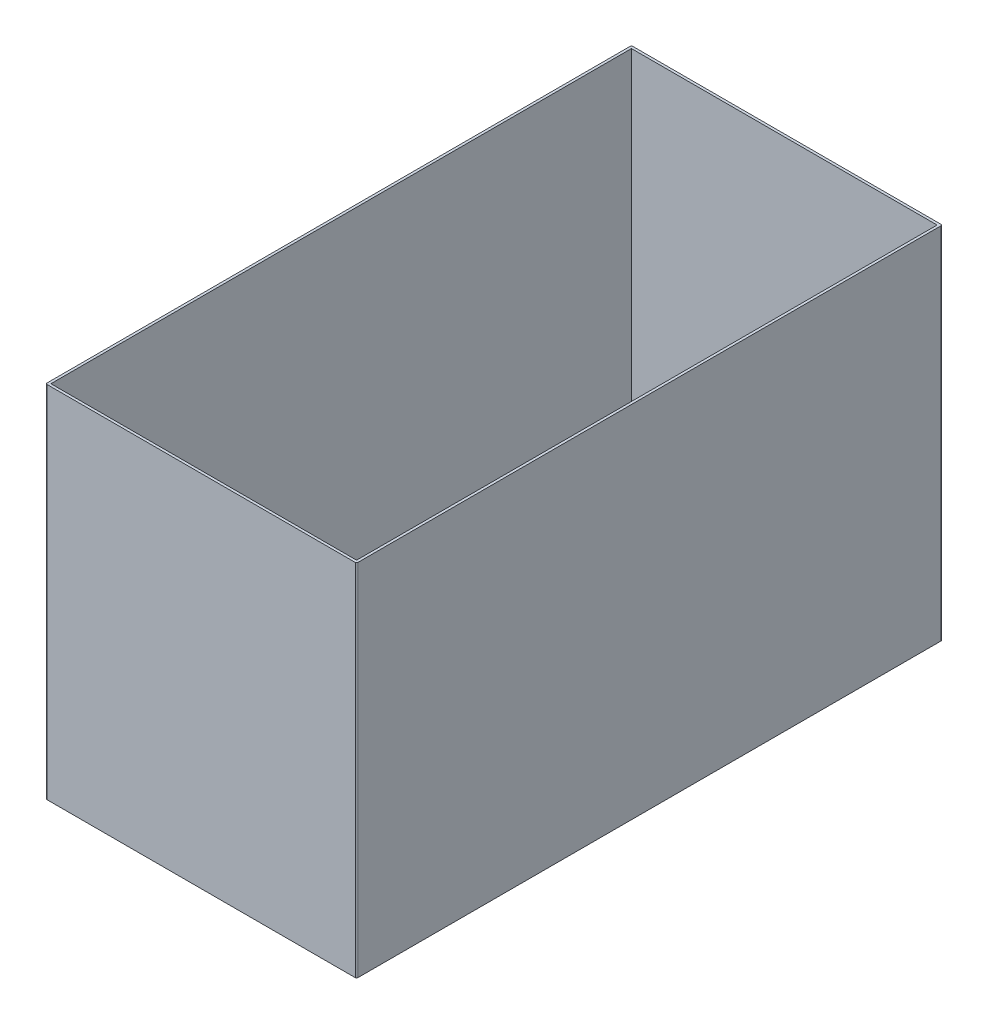
ISO-10303-21;
HEADER;
FILE_DESCRIPTION(('STEP AP214'),'2;1');
FILE_NAME('part.step','',(''),(''),'','','');
FILE_SCHEMA(('AUTOMOTIVE_DESIGN { 1 0 10303 214 1 1 1 1 }'));
ENDSEC;
DATA;
#1=APPLICATION_CONTEXT('core data for automotive mechanical design processes');
#2=APPLICATION_PROTOCOL_DEFINITION('international standard','automotive_design',2000,#1);
#3=PRODUCT_CONTEXT('',#1,'mechanical');
#4=PRODUCT('Part','Part','',(#3));
#5=PRODUCT_RELATED_PRODUCT_CATEGORY('part','',(#4));
#6=PRODUCT_DEFINITION_FORMATION('','',#4);
#7=PRODUCT_DEFINITION_CONTEXT('part definition',#1,'design');
#8=PRODUCT_DEFINITION('design','',#6,#7);
#9=PRODUCT_DEFINITION_SHAPE('','',#8);
#10=(LENGTH_UNIT() NAMED_UNIT(*) SI_UNIT(.MILLI.,.METRE.));
#11=(NAMED_UNIT(*) PLANE_ANGLE_UNIT() SI_UNIT($,.RADIAN.));
#12=(NAMED_UNIT(*) SI_UNIT($,.STERADIAN.) SOLID_ANGLE_UNIT());
#13=UNCERTAINTY_MEASURE_WITH_UNIT(LENGTH_MEASURE(1.E-05),#10,'distance_accuracy_value','');
#14=(GEOMETRIC_REPRESENTATION_CONTEXT(3) GLOBAL_UNCERTAINTY_ASSIGNED_CONTEXT((#13)) GLOBAL_UNIT_ASSIGNED_CONTEXT((#10,
#11,#12)) REPRESENTATION_CONTEXT('',''));
#15=CARTESIAN_POINT('',(0.,0.,0.));
#16=DIRECTION('',(0.,0.,1.));
#17=DIRECTION('',(1.,0.,0.));
#18=AXIS2_PLACEMENT_3D('',#15,#16,#17);
#19=CARTESIAN_POINT('',(0.,7.,0.));
#20=DIRECTION('',(0.,1.,0.));
#21=DIRECTION('',(0.,0.,1.));
#22=AXIS2_PLACEMENT_3D('',#19,#20,#21);
#23=PLANE('',#22);
#24=DIRECTION('',(0.,0.,-1.));
#25=VECTOR('',#24,1.);
#26=CARTESIAN_POINT('',(6.05,7.,11.3));
#27=LINE('',#26,#25);
#28=CARTESIAN_POINT('',(6.05,7.,11.35));
#29=VERTEX_POINT('',#28);
#30=CARTESIAN_POINT('',(6.05,7.,-11.35));
#31=VERTEX_POINT('',#30);
#32=EDGE_CURVE('E202',#29,#31,#27,.T.);
#33=ORIENTED_EDGE('',*,*,#32,.T.);
#34=CARTESIAN_POINT('',(6.,7.,-11.35));
#35=DIRECTION('',(0.,1.,0.));
#36=DIRECTION('',(0.,0.,1.));
#37=AXIS2_PLACEMENT_3D('',#34,#35,#36);
#38=CIRCLE('',#37,0.05);
#39=CARTESIAN_POINT('',(6.,7.,-11.4));
#40=VERTEX_POINT('',#39);
#41=EDGE_CURVE('E240',#31,#40,#38,.T.);
#42=ORIENTED_EDGE('',*,*,#41,.T.);
#43=DIRECTION('',(-1.,0.,0.));
#44=VECTOR('',#43,1.);
#45=CARTESIAN_POINT('',(5.95,7.,-11.4));
#46=LINE('',#45,#44);
#47=CARTESIAN_POINT('',(-6.,7.,-11.4));
#48=VERTEX_POINT('',#47);
#49=EDGE_CURVE('E205',#40,#48,#46,.T.);
#50=ORIENTED_EDGE('',*,*,#49,.T.);
#51=CARTESIAN_POINT('',(-6.,7.,-11.35));
#52=DIRECTION('',(0.,1.,0.));
#53=DIRECTION('',(0.,0.,1.));
#54=AXIS2_PLACEMENT_3D('',#51,#52,#53);
#55=CIRCLE('',#54,0.05);
#56=CARTESIAN_POINT('',(-6.05,7.,-11.35));
#57=VERTEX_POINT('',#56);
#58=EDGE_CURVE('E238',#48,#57,#55,.T.);
#59=ORIENTED_EDGE('',*,*,#58,.T.);
#60=DIRECTION('',(0.,0.,1.));
#61=VECTOR('',#60,1.);
#62=CARTESIAN_POINT('',(-6.05,7.,11.3));
#63=LINE('',#62,#61);
#64=CARTESIAN_POINT('',(-6.05,7.,11.35));
#65=VERTEX_POINT('',#64);
#66=EDGE_CURVE('E197',#57,#65,#63,.T.);
#67=ORIENTED_EDGE('',*,*,#66,.T.);
#68=CARTESIAN_POINT('',(-6.,7.,11.35));
#69=DIRECTION('',(0.,1.,0.));
#70=DIRECTION('',(0.,0.,1.));
#71=AXIS2_PLACEMENT_3D('',#68,#69,#70);
#72=CIRCLE('',#71,0.05);
#73=CARTESIAN_POINT('',(-6.,7.,11.4));
#74=VERTEX_POINT('',#73);
#75=EDGE_CURVE('E86',#65,#74,#72,.T.);
#76=ORIENTED_EDGE('',*,*,#75,.T.);
#77=DIRECTION('',(1.,0.,0.));
#78=VECTOR('',#77,1.);
#79=CARTESIAN_POINT('',(5.95,7.,11.4));
#80=LINE('',#79,#78);
#81=CARTESIAN_POINT('',(6.,7.,11.4));
#82=VERTEX_POINT('',#81);
#83=EDGE_CURVE('E199',#74,#82,#80,.T.);
#84=ORIENTED_EDGE('',*,*,#83,.T.);
#85=CARTESIAN_POINT('',(6.,7.,11.35));
#86=DIRECTION('',(0.,1.,0.));
#87=DIRECTION('',(0.,0.,1.));
#88=AXIS2_PLACEMENT_3D('',#85,#86,#87);
#89=CIRCLE('',#88,0.05);
#90=EDGE_CURVE('E235',#82,#29,#89,.T.);
#91=ORIENTED_EDGE('',*,*,#90,.T.);
#92=EDGE_LOOP('',(#33,#42,#50,#59,#67,#76,#84,#91));
#93=FACE_BOUND('',#92,.T.);
#94=DIRECTION('',(1.,0.,0.));
#95=VECTOR('',#94,1.);
#96=CARTESIAN_POINT('',(5.95,7.,11.3));
#97=LINE('',#96,#95);
#98=CARTESIAN_POINT('',(-5.95,7.,11.3));
#99=VERTEX_POINT('',#98);
#100=CARTESIAN_POINT('',(5.95,7.,11.3));
#101=VERTEX_POINT('',#100);
#102=EDGE_CURVE('E166',#99,#101,#97,.T.);
#103=ORIENTED_EDGE('',*,*,#102,.F.);
#104=DIRECTION('',(0.,0.,1.));
#105=VECTOR('',#104,1.);
#106=CARTESIAN_POINT('',(-5.95,7.,11.3));
#107=LINE('',#106,#105);
#108=CARTESIAN_POINT('',(-5.95,7.,-11.3));
#109=VERTEX_POINT('',#108);
#110=EDGE_CURVE('E156',#109,#99,#107,.T.);
#111=ORIENTED_EDGE('',*,*,#110,.F.);
#112=DIRECTION('',(-1.,0.,0.));
#113=VECTOR('',#112,1.);
#114=CARTESIAN_POINT('',(5.95,7.,-11.3));
#115=LINE('',#114,#113);
#116=CARTESIAN_POINT('',(5.95,7.,-11.3));
#117=VERTEX_POINT('',#116);
#118=EDGE_CURVE('E181',#117,#109,#115,.T.);
#119=ORIENTED_EDGE('',*,*,#118,.F.);
#120=DIRECTION('',(0.,0.,-1.));
#121=VECTOR('',#120,1.);
#122=CARTESIAN_POINT('',(5.95,7.,11.3));
#123=LINE('',#122,#121);
#124=EDGE_CURVE('E179',#101,#117,#123,.T.);
#125=ORIENTED_EDGE('',*,*,#124,.F.);
#126=EDGE_LOOP('',(#103,#111,#119,#125));
#127=FACE_BOUND('',#126,.T.);
#128=ADVANCED_FACE('F65',(#93,#127),#23,.T.);
#129=CARTESIAN_POINT('',(0.,-7.,0.));
#130=DIRECTION('',(0.,1.,0.));
#131=DIRECTION('',(0.,0.,1.));
#132=AXIS2_PLACEMENT_3D('',#129,#130,#131);
#133=PLANE('',#132);
#134=DIRECTION('',(-1.,0.,0.));
#135=VECTOR('',#134,1.);
#136=CARTESIAN_POINT('',(5.95,-7.,-11.4));
#137=LINE('',#136,#135);
#138=CARTESIAN_POINT('',(6.,-7.,-11.4));
#139=VERTEX_POINT('',#138);
#140=CARTESIAN_POINT('',(-6.,-7.,-11.4));
#141=VERTEX_POINT('',#140);
#142=EDGE_CURVE('E200',#139,#141,#137,.T.);
#143=ORIENTED_EDGE('',*,*,#142,.F.);
#144=CARTESIAN_POINT('',(6.,-7.,-11.35));
#145=DIRECTION('',(0.,1.,0.));
#146=DIRECTION('',(0.,0.,1.));
#147=AXIS2_PLACEMENT_3D('',#144,#145,#146);
#148=CIRCLE('',#147,0.05);
#149=CARTESIAN_POINT('',(6.05,-7.,-11.35));
#150=VERTEX_POINT('',#149);
#151=EDGE_CURVE('E228',#139,#150,#148,.F.);
#152=ORIENTED_EDGE('',*,*,#151,.T.);
#153=DIRECTION('',(0.,0.,-1.));
#154=VECTOR('',#153,1.);
#155=CARTESIAN_POINT('',(6.05,-7.,11.3));
#156=LINE('',#155,#154);
#157=CARTESIAN_POINT('',(6.05,-7.,11.35));
#158=VERTEX_POINT('',#157);
#159=EDGE_CURVE('E213',#158,#150,#156,.T.);
#160=ORIENTED_EDGE('',*,*,#159,.F.);
#161=CARTESIAN_POINT('',(6.,-7.,11.35));
#162=DIRECTION('',(0.,1.,0.));
#163=DIRECTION('',(0.,0.,1.));
#164=AXIS2_PLACEMENT_3D('',#161,#162,#163);
#165=CIRCLE('',#164,0.05);
#166=CARTESIAN_POINT('',(6.,-7.,11.4));
#167=VERTEX_POINT('',#166);
#168=EDGE_CURVE('E222',#158,#167,#165,.F.);
#169=ORIENTED_EDGE('',*,*,#168,.T.);
#170=DIRECTION('',(1.,0.,0.));
#171=VECTOR('',#170,1.);
#172=CARTESIAN_POINT('',(5.95,-7.,11.4));
#173=LINE('',#172,#171);
#174=CARTESIAN_POINT('',(-6.,-7.,11.4));
#175=VERTEX_POINT('',#174);
#176=EDGE_CURVE('E211',#175,#167,#173,.T.);
#177=ORIENTED_EDGE('',*,*,#176,.F.);
#178=CARTESIAN_POINT('',(-6.,-7.,11.35));
#179=DIRECTION('',(0.,1.,0.));
#180=DIRECTION('',(0.,0.,1.));
#181=AXIS2_PLACEMENT_3D('',#178,#179,#180);
#182=CIRCLE('',#181,0.05);
#183=CARTESIAN_POINT('',(-6.05,-7.,11.35));
#184=VERTEX_POINT('',#183);
#185=EDGE_CURVE('E224',#175,#184,#182,.F.);
#186=ORIENTED_EDGE('',*,*,#185,.T.);
#187=DIRECTION('',(0.,0.,1.));
#188=VECTOR('',#187,1.);
#189=CARTESIAN_POINT('',(-6.05,-7.,11.3));
#190=LINE('',#189,#188);
#191=CARTESIAN_POINT('',(-6.05,-7.,-11.35));
#192=VERTEX_POINT('',#191);
#193=EDGE_CURVE('E174',#192,#184,#190,.T.);
#194=ORIENTED_EDGE('',*,*,#193,.F.);
#195=CARTESIAN_POINT('',(-6.,-7.,-11.35));
#196=DIRECTION('',(0.,1.,0.));
#197=DIRECTION('',(0.,0.,1.));
#198=AXIS2_PLACEMENT_3D('',#195,#196,#197);
#199=CIRCLE('',#198,0.05);
#200=EDGE_CURVE('E226',#192,#141,#199,.F.);
#201=ORIENTED_EDGE('',*,*,#200,.T.);
#202=EDGE_LOOP('',(#143,#152,#160,#169,#177,#186,#194,#201));
#203=FACE_BOUND('',#202,.T.);
#204=DIRECTION('',(0.,0.,1.));
#205=VECTOR('',#204,1.);
#206=CARTESIAN_POINT('',(-5.95,-7.,11.3));
#207=LINE('',#206,#205);
#208=CARTESIAN_POINT('',(-5.95,-7.,-11.3));
#209=VERTEX_POINT('',#208);
#210=CARTESIAN_POINT('',(-5.95,-7.,11.3));
#211=VERTEX_POINT('',#210);
#212=EDGE_CURVE('E185',#209,#211,#207,.T.);
#213=ORIENTED_EDGE('',*,*,#212,.T.);
#214=DIRECTION('',(1.,0.,0.));
#215=VECTOR('',#214,1.);
#216=CARTESIAN_POINT('',(5.95,-7.,11.3));
#217=LINE('',#216,#215);
#218=CARTESIAN_POINT('',(5.95,-7.,11.3));
#219=VERTEX_POINT('',#218);
#220=EDGE_CURVE('E173',#211,#219,#217,.T.);
#221=ORIENTED_EDGE('',*,*,#220,.T.);
#222=DIRECTION('',(0.,0.,-1.));
#223=VECTOR('',#222,1.);
#224=CARTESIAN_POINT('',(5.95,-7.,11.3));
#225=LINE('',#224,#223);
#226=CARTESIAN_POINT('',(5.95,-7.,-11.3));
#227=VERTEX_POINT('',#226);
#228=EDGE_CURVE('E188',#219,#227,#225,.T.);
#229=ORIENTED_EDGE('',*,*,#228,.T.);
#230=DIRECTION('',(-1.,0.,0.));
#231=VECTOR('',#230,1.);
#232=CARTESIAN_POINT('',(5.95,-7.,-11.3));
#233=LINE('',#232,#231);
#234=EDGE_CURVE('E167',#227,#209,#233,.T.);
#235=ORIENTED_EDGE('',*,*,#234,.T.);
#236=EDGE_LOOP('',(#213,#221,#229,#235));
#237=FACE_BOUND('',#236,.T.);
#238=ADVANCED_FACE('F256',(#203,#237),#133,.F.);
#239=CARTESIAN_POINT('',(-6.05,7.,11.3));
#240=DIRECTION('',(1.,0.,0.));
#241=DIRECTION('',(0.,0.,-1.));
#242=AXIS2_PLACEMENT_3D('',#239,#240,#241);
#243=PLANE('',#242);
#244=ORIENTED_EDGE('',*,*,#66,.F.);
#245=DIRECTION('',(0.,-1.,0.));
#246=VECTOR('',#245,1.);
#247=CARTESIAN_POINT('',(-6.05,7.,-11.35));
#248=LINE('',#247,#246);
#249=EDGE_CURVE('E244',#57,#192,#248,.T.);
#250=ORIENTED_EDGE('',*,*,#249,.T.);
#251=ORIENTED_EDGE('',*,*,#193,.T.);
#252=DIRECTION('',(0.,-1.,0.));
#253=VECTOR('',#252,1.);
#254=CARTESIAN_POINT('',(-6.05,7.,11.35));
#255=LINE('',#254,#253);
#256=EDGE_CURVE('E242',#184,#65,#255,.F.);
#257=ORIENTED_EDGE('',*,*,#256,.T.);
#258=EDGE_LOOP('',(#244,#250,#251,#257));
#259=FACE_BOUND('',#258,.T.);
#260=ADVANCED_FACE('F250',(#259),#243,.F.);
#261=CARTESIAN_POINT('',(5.95,7.,11.4));
#262=DIRECTION('',(0.,0.,-1.));
#263=DIRECTION('',(-1.,0.,0.));
#264=AXIS2_PLACEMENT_3D('',#261,#262,#263);
#265=PLANE('',#264);
#266=ORIENTED_EDGE('',*,*,#83,.F.);
#267=DIRECTION('',(0.,-1.,0.));
#268=VECTOR('',#267,1.);
#269=CARTESIAN_POINT('',(-6.,7.,11.4));
#270=LINE('',#269,#268);
#271=EDGE_CURVE('E12',#74,#175,#270,.T.);
#272=ORIENTED_EDGE('',*,*,#271,.T.);
#273=ORIENTED_EDGE('',*,*,#176,.T.);
#274=DIRECTION('',(0.,-1.,0.));
#275=VECTOR('',#274,1.);
#276=CARTESIAN_POINT('',(6.,7.,11.4));
#277=LINE('',#276,#275);
#278=EDGE_CURVE('E73',#167,#82,#277,.F.);
#279=ORIENTED_EDGE('',*,*,#278,.T.);
#280=EDGE_LOOP('',(#266,#272,#273,#279));
#281=FACE_BOUND('',#280,.T.);
#282=ADVANCED_FACE('F262',(#281),#265,.F.);
#283=CARTESIAN_POINT('',(6.05,7.,11.3));
#284=DIRECTION('',(-1.,0.,0.));
#285=DIRECTION('',(0.,0.,1.));
#286=AXIS2_PLACEMENT_3D('',#283,#284,#285);
#287=PLANE('',#286);
#288=ORIENTED_EDGE('',*,*,#159,.T.);
#289=DIRECTION('',(0.,-1.,0.));
#290=VECTOR('',#289,1.);
#291=CARTESIAN_POINT('',(6.05,7.,-11.35));
#292=LINE('',#291,#290);
#293=EDGE_CURVE('E233',#150,#31,#292,.F.);
#294=ORIENTED_EDGE('',*,*,#293,.T.);
#295=ORIENTED_EDGE('',*,*,#32,.F.);
#296=DIRECTION('',(0.,-1.,0.));
#297=VECTOR('',#296,1.);
#298=CARTESIAN_POINT('',(6.05,7.,11.35));
#299=LINE('',#298,#297);
#300=EDGE_CURVE('E230',#29,#158,#299,.T.);
#301=ORIENTED_EDGE('',*,*,#300,.T.);
#302=EDGE_LOOP('',(#288,#294,#295,#301));
#303=FACE_BOUND('',#302,.T.);
#304=ADVANCED_FACE('F269',(#303),#287,.F.);
#305=CARTESIAN_POINT('',(5.95,7.,-11.4));
#306=DIRECTION('',(0.,0.,1.));
#307=DIRECTION('',(1.,0.,0.));
#308=AXIS2_PLACEMENT_3D('',#305,#306,#307);
#309=PLANE('',#308);
#310=ORIENTED_EDGE('',*,*,#49,.F.);
#311=DIRECTION('',(0.,-1.,0.));
#312=VECTOR('',#311,1.);
#313=CARTESIAN_POINT('',(6.,7.,-11.4));
#314=LINE('',#313,#312);
#315=EDGE_CURVE('E219',#40,#139,#314,.T.);
#316=ORIENTED_EDGE('',*,*,#315,.T.);
#317=ORIENTED_EDGE('',*,*,#142,.T.);
#318=DIRECTION('',(0.,-1.,0.));
#319=VECTOR('',#318,1.);
#320=CARTESIAN_POINT('',(-6.,7.,-11.4));
#321=LINE('',#320,#319);
#322=EDGE_CURVE('E208',#141,#48,#321,.F.);
#323=ORIENTED_EDGE('',*,*,#322,.T.);
#324=EDGE_LOOP('',(#310,#316,#317,#323));
#325=FACE_BOUND('',#324,.T.);
#326=ADVANCED_FACE('F277',(#325),#309,.F.);
#327=CARTESIAN_POINT('',(-5.95,7.,11.3));
#328=DIRECTION('',(1.,0.,0.));
#329=DIRECTION('',(0.,0.,-1.));
#330=AXIS2_PLACEMENT_3D('',#327,#328,#329);
#331=PLANE('',#330);
#332=ORIENTED_EDGE('',*,*,#212,.F.);
#333=DIRECTION('',(0.,-1.,0.));
#334=VECTOR('',#333,1.);
#335=CARTESIAN_POINT('',(-5.95,7.,-11.3));
#336=LINE('',#335,#334);
#337=EDGE_CURVE('E162',#109,#209,#336,.T.);
#338=ORIENTED_EDGE('',*,*,#337,.F.);
#339=ORIENTED_EDGE('',*,*,#110,.T.);
#340=DIRECTION('',(0.,-1.,0.));
#341=VECTOR('',#340,1.);
#342=CARTESIAN_POINT('',(-5.95,7.,11.3));
#343=LINE('',#342,#341);
#344=EDGE_CURVE('E159',#99,#211,#343,.T.);
#345=ORIENTED_EDGE('',*,*,#344,.T.);
#346=EDGE_LOOP('',(#332,#338,#339,#345));
#347=FACE_BOUND('',#346,.T.);
#348=ADVANCED_FACE('F158',(#347),#331,.T.);
#349=CARTESIAN_POINT('',(5.95,7.,11.3));
#350=DIRECTION('',(0.,0.,-1.));
#351=DIRECTION('',(-1.,0.,0.));
#352=AXIS2_PLACEMENT_3D('',#349,#350,#351);
#353=PLANE('',#352);
#354=ORIENTED_EDGE('',*,*,#220,.F.);
#355=ORIENTED_EDGE('',*,*,#344,.F.);
#356=ORIENTED_EDGE('',*,*,#102,.T.);
#357=DIRECTION('',(0.,-1.,0.));
#358=VECTOR('',#357,1.);
#359=CARTESIAN_POINT('',(5.95,7.,11.3));
#360=LINE('',#359,#358);
#361=EDGE_CURVE('E175',#101,#219,#360,.T.);
#362=ORIENTED_EDGE('',*,*,#361,.T.);
#363=EDGE_LOOP('',(#354,#355,#356,#362));
#364=FACE_BOUND('',#363,.T.);
#365=ADVANCED_FACE('F170',(#364),#353,.T.);
#366=CARTESIAN_POINT('',(5.95,7.,11.3));
#367=DIRECTION('',(-1.,0.,0.));
#368=DIRECTION('',(0.,0.,1.));
#369=AXIS2_PLACEMENT_3D('',#366,#367,#368);
#370=PLANE('',#369);
#371=ORIENTED_EDGE('',*,*,#228,.F.);
#372=ORIENTED_EDGE('',*,*,#361,.F.);
#373=ORIENTED_EDGE('',*,*,#124,.T.);
#374=DIRECTION('',(0.,-1.,0.));
#375=VECTOR('',#374,1.);
#376=CARTESIAN_POINT('',(5.95,7.,-11.3));
#377=LINE('',#376,#375);
#378=EDGE_CURVE('E194',#117,#227,#377,.T.);
#379=ORIENTED_EDGE('',*,*,#378,.T.);
#380=EDGE_LOOP('',(#371,#372,#373,#379));
#381=FACE_BOUND('',#380,.T.);
#382=ADVANCED_FACE('F356',(#381),#370,.T.);
#383=CARTESIAN_POINT('',(5.95,7.,-11.3));
#384=DIRECTION('',(0.,0.,1.));
#385=DIRECTION('',(1.,0.,0.));
#386=AXIS2_PLACEMENT_3D('',#383,#384,#385);
#387=PLANE('',#386);
#388=ORIENTED_EDGE('',*,*,#234,.F.);
#389=ORIENTED_EDGE('',*,*,#378,.F.);
#390=ORIENTED_EDGE('',*,*,#118,.T.);
#391=ORIENTED_EDGE('',*,*,#337,.T.);
#392=EDGE_LOOP('',(#388,#389,#390,#391));
#393=FACE_BOUND('',#392,.T.);
#394=ADVANCED_FACE('F286',(#393),#387,.T.);
#395=CARTESIAN_POINT('',(6.,7.,-11.35));
#396=DIRECTION('',(0.,-1.,0.));
#397=DIRECTION('',(0.,0.,-1.));
#398=AXIS2_PLACEMENT_3D('',#395,#396,#397);
#399=CYLINDRICAL_SURFACE('',#398,0.05);
#400=ORIENTED_EDGE('',*,*,#41,.F.);
#401=ORIENTED_EDGE('',*,*,#293,.F.);
#402=ORIENTED_EDGE('',*,*,#151,.F.);
#403=ORIENTED_EDGE('',*,*,#315,.F.);
#404=EDGE_LOOP('',(#400,#401,#402,#403));
#405=FACE_BOUND('',#404,.T.);
#406=ADVANCED_FACE('F274',(#405),#399,.T.);
#407=CARTESIAN_POINT('',(-6.,7.,-11.35));
#408=DIRECTION('',(0.,-1.,0.));
#409=DIRECTION('',(0.,0.,-1.));
#410=AXIS2_PLACEMENT_3D('',#407,#408,#409);
#411=CYLINDRICAL_SURFACE('',#410,0.05);
#412=ORIENTED_EDGE('',*,*,#58,.F.);
#413=ORIENTED_EDGE('',*,*,#322,.F.);
#414=ORIENTED_EDGE('',*,*,#200,.F.);
#415=ORIENTED_EDGE('',*,*,#249,.F.);
#416=EDGE_LOOP('',(#412,#413,#414,#415));
#417=FACE_BOUND('',#416,.T.);
#418=ADVANCED_FACE('F279',(#417),#411,.T.);
#419=CARTESIAN_POINT('',(-6.,7.,11.35));
#420=DIRECTION('',(0.,-1.,0.));
#421=DIRECTION('',(0.,0.,-1.));
#422=AXIS2_PLACEMENT_3D('',#419,#420,#421);
#423=CYLINDRICAL_SURFACE('',#422,0.05);
#424=ORIENTED_EDGE('',*,*,#75,.F.);
#425=ORIENTED_EDGE('',*,*,#256,.F.);
#426=ORIENTED_EDGE('',*,*,#185,.F.);
#427=ORIENTED_EDGE('',*,*,#271,.F.);
#428=EDGE_LOOP('',(#424,#425,#426,#427));
#429=FACE_BOUND('',#428,.T.);
#430=ADVANCED_FACE('F261',(#429),#423,.T.);
#431=CARTESIAN_POINT('',(6.,7.,11.35));
#432=DIRECTION('',(0.,-1.,0.));
#433=DIRECTION('',(0.,0.,-1.));
#434=AXIS2_PLACEMENT_3D('',#431,#432,#433);
#435=CYLINDRICAL_SURFACE('',#434,0.05);
#436=ORIENTED_EDGE('',*,*,#90,.F.);
#437=ORIENTED_EDGE('',*,*,#278,.F.);
#438=ORIENTED_EDGE('',*,*,#168,.F.);
#439=ORIENTED_EDGE('',*,*,#300,.F.);
#440=EDGE_LOOP('',(#436,#437,#438,#439));
#441=FACE_BOUND('',#440,.T.);
#442=ADVANCED_FACE('F67',(#441),#435,.T.);
#443=CLOSED_SHELL('',(#128,#238,#260,#282,#304,#326,#348,#365,#382,#394,#406,#418,#430,#442));
#444=MANIFOLD_SOLID_BREP('B2',#443);
#445=ADVANCED_BREP_SHAPE_REPRESENTATION('',(#18,#444),#14);
#446=SHAPE_DEFINITION_REPRESENTATION(#9,#445);
ENDSEC;
END-ISO-10303-21;
